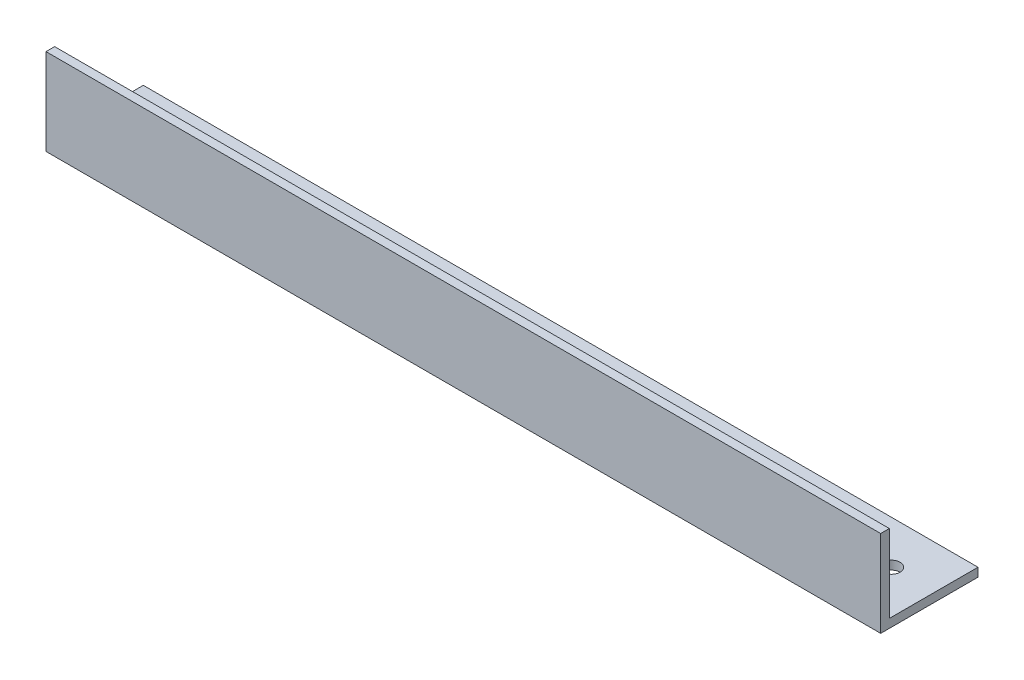
ISO-10303-21;
HEADER;
FILE_DESCRIPTION(('STEP AP214'),'2;1');
FILE_NAME('part.step','',(''),(''),'','','');
FILE_SCHEMA(('AUTOMOTIVE_DESIGN { 1 0 10303 214 1 1 1 1 }'));
ENDSEC;
DATA;
#1=APPLICATION_CONTEXT('core data for automotive mechanical design processes');
#2=APPLICATION_PROTOCOL_DEFINITION('international standard','automotive_design',2000,#1);
#3=PRODUCT_CONTEXT('',#1,'mechanical');
#4=PRODUCT('Part','Part','',(#3));
#5=PRODUCT_RELATED_PRODUCT_CATEGORY('part','',(#4));
#6=PRODUCT_DEFINITION_FORMATION('','',#4);
#7=PRODUCT_DEFINITION_CONTEXT('part definition',#1,'design');
#8=PRODUCT_DEFINITION('design','',#6,#7);
#9=PRODUCT_DEFINITION_SHAPE('','',#8);
#10=(LENGTH_UNIT() NAMED_UNIT(*) SI_UNIT(.MILLI.,.METRE.));
#11=(NAMED_UNIT(*) PLANE_ANGLE_UNIT() SI_UNIT($,.RADIAN.));
#12=(NAMED_UNIT(*) SI_UNIT($,.STERADIAN.) SOLID_ANGLE_UNIT());
#13=UNCERTAINTY_MEASURE_WITH_UNIT(LENGTH_MEASURE(1.E-05),#10,'distance_accuracy_value','');
#14=(GEOMETRIC_REPRESENTATION_CONTEXT(3) GLOBAL_UNCERTAINTY_ASSIGNED_CONTEXT((#13)) GLOBAL_UNIT_ASSIGNED_CONTEXT((#10,
#11,#12)) REPRESENTATION_CONTEXT('',''));
#15=CARTESIAN_POINT('',(0.,0.,0.));
#16=DIRECTION('',(0.,0.,1.));
#17=DIRECTION('',(1.,0.,0.));
#18=AXIS2_PLACEMENT_3D('',#15,#16,#17);
#19=CARTESIAN_POINT('',(0.,0.,0.));
#20=DIRECTION('',(-1.,0.,0.));
#21=DIRECTION('',(0.,0.,-1.));
#22=AXIS2_PLACEMENT_3D('',#19,#20,#21);
#23=PLANE('',#22);
#24=DIRECTION('',(0.,0.,-1.));
#25=VECTOR('',#24,1.);
#26=CARTESIAN_POINT('',(0.,0.,0.));
#27=LINE('',#26,#25);
#28=CARTESIAN_POINT('',(0.,0.,0.));
#29=VERTEX_POINT('',#28);
#30=CARTESIAN_POINT('',(0.,0.,-22.5));
#31=VERTEX_POINT('',#30);
#32=EDGE_CURVE('E151',#29,#31,#27,.T.);
#33=ORIENTED_EDGE('',*,*,#32,.F.);
#34=DIRECTION('',(0.,-1.,0.));
#35=VECTOR('',#34,1.);
#36=CARTESIAN_POINT('',(0.,20.,0.));
#37=LINE('',#36,#35);
#38=CARTESIAN_POINT('',(0.,20.,0.));
#39=VERTEX_POINT('',#38);
#40=EDGE_CURVE('E87',#39,#29,#37,.T.);
#41=ORIENTED_EDGE('',*,*,#40,.F.);
#42=DIRECTION('',(0.,0.,1.));
#43=VECTOR('',#42,1.);
#44=CARTESIAN_POINT('',(0.,20.,0.));
#45=LINE('',#44,#43);
#46=CARTESIAN_POINT('',(0.,20.,-2.));
#47=VERTEX_POINT('',#46);
#48=EDGE_CURVE('E11',#47,#39,#45,.T.);
#49=ORIENTED_EDGE('',*,*,#48,.F.);
#50=DIRECTION('',(0.,-1.,0.));
#51=VECTOR('',#50,1.);
#52=CARTESIAN_POINT('',(0.,20.,-2.));
#53=LINE('',#52,#51);
#54=CARTESIAN_POINT('',(0.,2.,-2.));
#55=VERTEX_POINT('',#54);
#56=EDGE_CURVE('E85',#47,#55,#53,.T.);
#57=ORIENTED_EDGE('',*,*,#56,.T.);
#58=DIRECTION('',(0.,0.,-1.));
#59=VECTOR('',#58,1.);
#60=CARTESIAN_POINT('',(0.,2.,0.));
#61=LINE('',#60,#59);
#62=CARTESIAN_POINT('',(0.,2.,-22.5));
#63=VERTEX_POINT('',#62);
#64=EDGE_CURVE('E109',#55,#63,#61,.T.);
#65=ORIENTED_EDGE('',*,*,#64,.T.);
#66=DIRECTION('',(0.,-1.,0.));
#67=VECTOR('',#66,1.);
#68=CARTESIAN_POINT('',(0.,0.,-22.5));
#69=LINE('',#68,#67);
#70=EDGE_CURVE('E47',#63,#31,#69,.T.);
#71=ORIENTED_EDGE('',*,*,#70,.T.);
#72=EDGE_LOOP('',(#33,#41,#49,#57,#65,#71));
#73=FACE_BOUND('',#72,.T.);
#74=ADVANCED_FACE('F37',(#73),#23,.T.);
#75=CARTESIAN_POINT('',(0.,0.,-22.5));
#76=DIRECTION('',(0.,0.,-1.));
#77=DIRECTION('',(1.,0.,0.));
#78=AXIS2_PLACEMENT_3D('',#75,#76,#77);
#79=PLANE('',#78);
#80=ORIENTED_EDGE('',*,*,#70,.F.);
#81=DIRECTION('',(1.,0.,0.));
#82=VECTOR('',#81,1.);
#83=CARTESIAN_POINT('',(0.,2.,-22.5));
#84=LINE('',#83,#82);
#85=CARTESIAN_POINT('',(193.,2.,-22.5));
#86=VERTEX_POINT('',#85);
#87=EDGE_CURVE('E137',#63,#86,#84,.T.);
#88=ORIENTED_EDGE('',*,*,#87,.T.);
#89=DIRECTION('',(0.,-1.,0.));
#90=VECTOR('',#89,1.);
#91=CARTESIAN_POINT('',(193.,0.,-22.5));
#92=LINE('',#91,#90);
#93=CARTESIAN_POINT('',(193.,0.,-22.5));
#94=VERTEX_POINT('',#93);
#95=EDGE_CURVE('E115',#86,#94,#92,.T.);
#96=ORIENTED_EDGE('',*,*,#95,.T.);
#97=DIRECTION('',(1.,0.,0.));
#98=VECTOR('',#97,1.);
#99=CARTESIAN_POINT('',(0.,0.,-22.5));
#100=LINE('',#99,#98);
#101=EDGE_CURVE('E156',#31,#94,#100,.T.);
#102=ORIENTED_EDGE('',*,*,#101,.F.);
#103=EDGE_LOOP('',(#80,#88,#96,#102));
#104=FACE_BOUND('',#103,.T.);
#105=ADVANCED_FACE('F161',(#104),#79,.T.);
#106=CARTESIAN_POINT('',(193.,20.,0.));
#107=DIRECTION('',(-1.,0.,0.));
#108=DIRECTION('',(0.,-1.,0.));
#109=AXIS2_PLACEMENT_3D('',#106,#107,#108);
#110=PLANE('',#109);
#111=DIRECTION('',(0.,-1.,0.));
#112=VECTOR('',#111,1.);
#113=CARTESIAN_POINT('',(193.,20.,0.));
#114=LINE('',#113,#112);
#115=CARTESIAN_POINT('',(193.,20.,0.));
#116=VERTEX_POINT('',#115);
#117=CARTESIAN_POINT('',(193.,0.,0.));
#118=VERTEX_POINT('',#117);
#119=EDGE_CURVE('E145',#116,#118,#114,.T.);
#120=ORIENTED_EDGE('',*,*,#119,.T.);
#121=DIRECTION('',(0.,0.,-1.));
#122=VECTOR('',#121,1.);
#123=CARTESIAN_POINT('',(193.,0.,0.));
#124=LINE('',#123,#122);
#125=EDGE_CURVE('E113',#118,#94,#124,.T.);
#126=ORIENTED_EDGE('',*,*,#125,.T.);
#127=ORIENTED_EDGE('',*,*,#95,.F.);
#128=DIRECTION('',(0.,0.,-1.));
#129=VECTOR('',#128,1.);
#130=CARTESIAN_POINT('',(193.,2.,0.));
#131=LINE('',#130,#129);
#132=CARTESIAN_POINT('',(193.,2.,-2.));
#133=VERTEX_POINT('',#132);
#134=EDGE_CURVE('E135',#133,#86,#131,.T.);
#135=ORIENTED_EDGE('',*,*,#134,.F.);
#136=DIRECTION('',(0.,-1.,0.));
#137=VECTOR('',#136,1.);
#138=CARTESIAN_POINT('',(193.,20.,-2.));
#139=LINE('',#138,#137);
#140=CARTESIAN_POINT('',(193.,20.,-2.));
#141=VERTEX_POINT('',#140);
#142=EDGE_CURVE('E98',#141,#133,#139,.T.);
#143=ORIENTED_EDGE('',*,*,#142,.F.);
#144=DIRECTION('',(0.,0.,1.));
#145=VECTOR('',#144,1.);
#146=CARTESIAN_POINT('',(193.,20.,0.));
#147=LINE('',#146,#145);
#148=EDGE_CURVE('E41',#141,#116,#147,.T.);
#149=ORIENTED_EDGE('',*,*,#148,.T.);
#150=EDGE_LOOP('',(#120,#126,#127,#135,#143,#149));
#151=FACE_BOUND('',#150,.T.);
#152=ADVANCED_FACE('F143',(#151),#110,.F.);
#153=CARTESIAN_POINT('',(0.,20.,0.));
#154=DIRECTION('',(0.,-1.,0.));
#155=DIRECTION('',(1.,0.,0.));
#156=AXIS2_PLACEMENT_3D('',#153,#154,#155);
#157=PLANE('',#156);
#158=DIRECTION('',(1.,0.,0.));
#159=VECTOR('',#158,1.);
#160=CARTESIAN_POINT('',(0.,20.,-2.));
#161=LINE('',#160,#159);
#162=EDGE_CURVE('E93',#47,#141,#161,.T.);
#163=ORIENTED_EDGE('',*,*,#162,.F.);
#164=ORIENTED_EDGE('',*,*,#48,.T.);
#165=DIRECTION('',(1.,0.,0.));
#166=VECTOR('',#165,1.);
#167=CARTESIAN_POINT('',(0.,20.,0.));
#168=LINE('',#167,#166);
#169=EDGE_CURVE('E157',#39,#116,#168,.T.);
#170=ORIENTED_EDGE('',*,*,#169,.T.);
#171=ORIENTED_EDGE('',*,*,#148,.F.);
#172=EDGE_LOOP('',(#163,#164,#170,#171));
#173=FACE_BOUND('',#172,.T.);
#174=ADVANCED_FACE('F94',(#173),#157,.F.);
#175=CARTESIAN_POINT('',(10.,0.,-12.5));
#176=DIRECTION('',(0.,-1.,0.));
#177=DIRECTION('',(0.,0.,-1.));
#178=AXIS2_PLACEMENT_3D('',#175,#176,#177);
#179=CYLINDRICAL_SURFACE('',#178,2.);
#180=CARTESIAN_POINT('',(10.,0.,-12.5));
#181=DIRECTION('',(0.,-1.,0.));
#182=DIRECTION('',(0.,0.,-1.));
#183=AXIS2_PLACEMENT_3D('',#180,#181,#182);
#184=CIRCLE('',#183,2.);
#185=CARTESIAN_POINT('',(10.,0.,-14.5));
#186=VERTEX_POINT('',#185);
#187=EDGE_CURVE('E126',#186,#186,#184,.T.);
#188=ORIENTED_EDGE('',*,*,#187,.T.);
#189=EDGE_LOOP('',(#188));
#190=FACE_BOUND('',#189,.T.);
#191=CARTESIAN_POINT('',(10.,2.,-12.5));
#192=DIRECTION('',(0.,-1.,0.));
#193=DIRECTION('',(0.,0.,-1.));
#194=AXIS2_PLACEMENT_3D('',#191,#192,#193);
#195=CIRCLE('',#194,2.);
#196=CARTESIAN_POINT('',(10.,2.,-14.5));
#197=VERTEX_POINT('',#196);
#198=EDGE_CURVE('E103',#197,#197,#195,.T.);
#199=ORIENTED_EDGE('',*,*,#198,.F.);
#200=EDGE_LOOP('',(#199));
#201=FACE_BOUND('',#200,.T.);
#202=ADVANCED_FACE('F39',(#190,#201),#179,.F.);
#203=CARTESIAN_POINT('',(183.,0.,-12.5));
#204=DIRECTION('',(0.,-1.,0.));
#205=DIRECTION('',(0.,0.,-1.));
#206=AXIS2_PLACEMENT_3D('',#203,#204,#205);
#207=CYLINDRICAL_SURFACE('',#206,2.00000000000002);
#208=CARTESIAN_POINT('',(183.,0.,-12.5));
#209=DIRECTION('',(0.,-1.,0.));
#210=DIRECTION('',(0.,0.,-1.));
#211=AXIS2_PLACEMENT_3D('',#208,#209,#210);
#212=CIRCLE('',#211,2.00000000000002);
#213=CARTESIAN_POINT('',(183.,0.,-14.5));
#214=VERTEX_POINT('',#213);
#215=EDGE_CURVE('E121',#214,#214,#212,.T.);
#216=ORIENTED_EDGE('',*,*,#215,.T.);
#217=EDGE_LOOP('',(#216));
#218=FACE_BOUND('',#217,.T.);
#219=CARTESIAN_POINT('',(183.,2.,-12.5));
#220=DIRECTION('',(0.,-1.,0.));
#221=DIRECTION('',(0.,0.,-1.));
#222=AXIS2_PLACEMENT_3D('',#219,#220,#221);
#223=CIRCLE('',#222,2.00000000000002);
#224=CARTESIAN_POINT('',(183.,2.,-14.5));
#225=VERTEX_POINT('',#224);
#226=EDGE_CURVE('E106',#225,#225,#223,.T.);
#227=ORIENTED_EDGE('',*,*,#226,.F.);
#228=EDGE_LOOP('',(#227));
#229=FACE_BOUND('',#228,.T.);
#230=ADVANCED_FACE('F173',(#218,#229),#207,.F.);
#231=CARTESIAN_POINT('',(0.,20.,0.));
#232=DIRECTION('',(0.,0.,1.));
#233=DIRECTION('',(0.,-1.,0.));
#234=AXIS2_PLACEMENT_3D('',#231,#232,#233);
#235=PLANE('',#234);
#236=ORIENTED_EDGE('',*,*,#119,.F.);
#237=ORIENTED_EDGE('',*,*,#169,.F.);
#238=ORIENTED_EDGE('',*,*,#40,.T.);
#239=DIRECTION('',(1.,0.,0.));
#240=VECTOR('',#239,1.);
#241=CARTESIAN_POINT('',(0.,0.,0.));
#242=LINE('',#241,#240);
#243=EDGE_CURVE('E149',#29,#118,#242,.T.);
#244=ORIENTED_EDGE('',*,*,#243,.T.);
#245=EDGE_LOOP('',(#236,#237,#238,#244));
#246=FACE_BOUND('',#245,.T.);
#247=ADVANCED_FACE('F175',(#246),#235,.T.);
#248=CARTESIAN_POINT('',(0.,0.,0.));
#249=DIRECTION('',(0.,-1.,0.));
#250=DIRECTION('',(0.,0.,-1.));
#251=AXIS2_PLACEMENT_3D('',#248,#249,#250);
#252=PLANE('',#251);
#253=ORIENTED_EDGE('',*,*,#215,.F.);
#254=EDGE_LOOP('',(#253));
#255=FACE_BOUND('',#254,.T.);
#256=ORIENTED_EDGE('',*,*,#187,.F.);
#257=EDGE_LOOP('',(#256));
#258=FACE_BOUND('',#257,.T.);
#259=ORIENTED_EDGE('',*,*,#125,.F.);
#260=ORIENTED_EDGE('',*,*,#243,.F.);
#261=ORIENTED_EDGE('',*,*,#32,.T.);
#262=ORIENTED_EDGE('',*,*,#101,.T.);
#263=EDGE_LOOP('',(#259,#260,#261,#262));
#264=FACE_BOUND('',#263,.T.);
#265=ADVANCED_FACE('F160',(#255,#258,#264),#252,.T.);
#266=CARTESIAN_POINT('',(0.,20.,-2.));
#267=DIRECTION('',(0.,0.,1.));
#268=DIRECTION('',(0.,-1.,0.));
#269=AXIS2_PLACEMENT_3D('',#266,#267,#268);
#270=PLANE('',#269);
#271=ORIENTED_EDGE('',*,*,#142,.T.);
#272=DIRECTION('',(1.,0.,0.));
#273=VECTOR('',#272,1.);
#274=CARTESIAN_POINT('',(0.,2.,-2.));
#275=LINE('',#274,#273);
#276=EDGE_CURVE('E101',#55,#133,#275,.T.);
#277=ORIENTED_EDGE('',*,*,#276,.F.);
#278=ORIENTED_EDGE('',*,*,#56,.F.);
#279=ORIENTED_EDGE('',*,*,#162,.T.);
#280=EDGE_LOOP('',(#271,#277,#278,#279));
#281=FACE_BOUND('',#280,.T.);
#282=ADVANCED_FACE('F100',(#281),#270,.F.);
#283=CARTESIAN_POINT('',(0.,2.,0.));
#284=DIRECTION('',(0.,-1.,0.));
#285=DIRECTION('',(0.,0.,-1.));
#286=AXIS2_PLACEMENT_3D('',#283,#284,#285);
#287=PLANE('',#286);
#288=ORIENTED_EDGE('',*,*,#226,.T.);
#289=EDGE_LOOP('',(#288));
#290=FACE_BOUND('',#289,.T.);
#291=ORIENTED_EDGE('',*,*,#198,.T.);
#292=EDGE_LOOP('',(#291));
#293=FACE_BOUND('',#292,.T.);
#294=ORIENTED_EDGE('',*,*,#134,.T.);
#295=ORIENTED_EDGE('',*,*,#87,.F.);
#296=ORIENTED_EDGE('',*,*,#64,.F.);
#297=ORIENTED_EDGE('',*,*,#276,.T.);
#298=EDGE_LOOP('',(#294,#295,#296,#297));
#299=FACE_BOUND('',#298,.T.);
#300=ADVANCED_FACE('F141',(#290,#293,#299),#287,.F.);
#301=CLOSED_SHELL('',(#74,#105,#152,#174,#202,#230,#247,#265,#282,#300));
#302=MANIFOLD_SOLID_BREP('B2',#301);
#303=ADVANCED_BREP_SHAPE_REPRESENTATION('',(#18,#302),#14);
#304=SHAPE_DEFINITION_REPRESENTATION(#9,#303);
ENDSEC;
END-ISO-10303-21;
